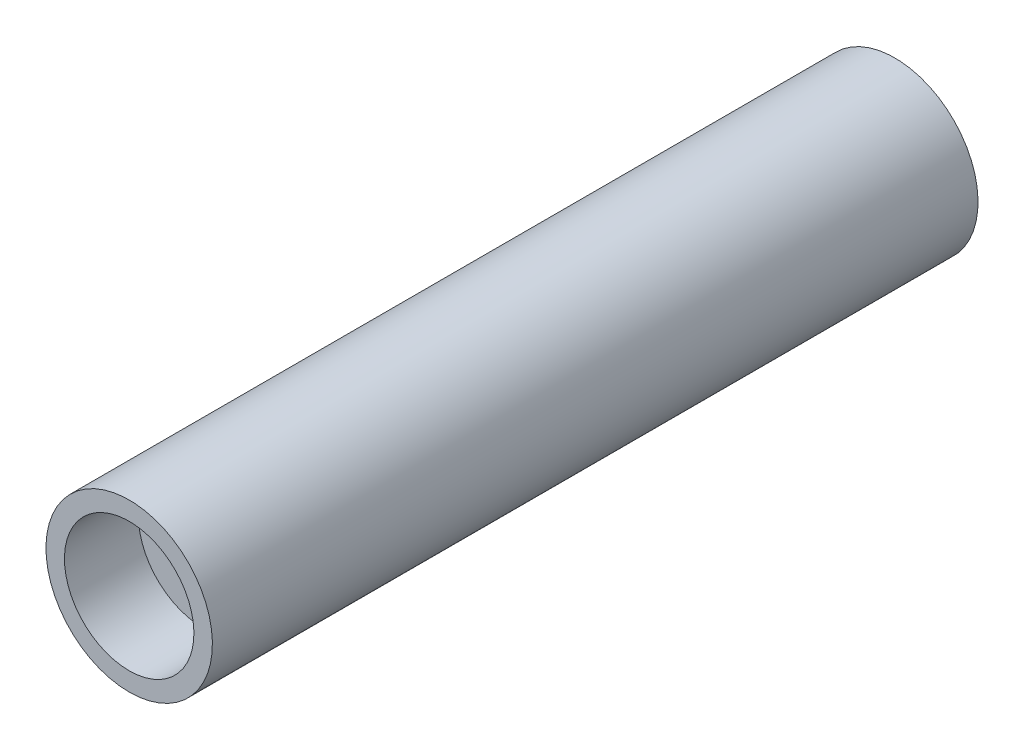
ISO-10303-21;
HEADER;
FILE_DESCRIPTION(('STEP AP214'),'2;1');
FILE_NAME('part.step','',(''),(''),'','','');
FILE_SCHEMA(('AUTOMOTIVE_DESIGN { 1 0 10303 214 1 1 1 1 }'));
ENDSEC;
DATA;
#1=APPLICATION_CONTEXT('core data for automotive mechanical design processes');
#2=APPLICATION_PROTOCOL_DEFINITION('international standard','automotive_design',2000,#1);
#3=PRODUCT_CONTEXT('',#1,'mechanical');
#4=PRODUCT('Part','Part','',(#3));
#5=PRODUCT_RELATED_PRODUCT_CATEGORY('part','',(#4));
#6=PRODUCT_DEFINITION_FORMATION('','',#4);
#7=PRODUCT_DEFINITION_CONTEXT('part definition',#1,'design');
#8=PRODUCT_DEFINITION('design','',#6,#7);
#9=PRODUCT_DEFINITION_SHAPE('','',#8);
#10=(LENGTH_UNIT() NAMED_UNIT(*) SI_UNIT(.MILLI.,.METRE.));
#11=(NAMED_UNIT(*) PLANE_ANGLE_UNIT() SI_UNIT($,.RADIAN.));
#12=(NAMED_UNIT(*) SI_UNIT($,.STERADIAN.) SOLID_ANGLE_UNIT());
#13=UNCERTAINTY_MEASURE_WITH_UNIT(LENGTH_MEASURE(1.E-05),#10,'distance_accuracy_value','');
#14=(GEOMETRIC_REPRESENTATION_CONTEXT(3) GLOBAL_UNCERTAINTY_ASSIGNED_CONTEXT((#13)) GLOBAL_UNIT_ASSIGNED_CONTEXT((#10,
#11,#12)) REPRESENTATION_CONTEXT('',''));
#15=CARTESIAN_POINT('',(0.,0.,0.));
#16=DIRECTION('',(0.,0.,1.));
#17=DIRECTION('',(1.,0.,0.));
#18=AXIS2_PLACEMENT_3D('',#15,#16,#17);
#19=CARTESIAN_POINT('',(0.,2.7,-12.42));
#20=DIRECTION('',(0.,0.,1.));
#21=DIRECTION('',(0.,-1.,0.));
#22=AXIS2_PLACEMENT_3D('',#19,#20,#21);
#23=PLANE('',#22);
#24=CARTESIAN_POINT('',(0.,0.,-12.42));
#25=DIRECTION('',(0.,0.,1.));
#26=DIRECTION('',(0.,-1.,0.));
#27=AXIS2_PLACEMENT_3D('',#24,#25,#26);
#28=CIRCLE('',#27,2.7);
#29=CARTESIAN_POINT('',(0.,-2.69999999999999,-12.42));
#30=VERTEX_POINT('',#29);
#31=EDGE_CURVE('E10',#30,#30,#28,.T.);
#32=ORIENTED_EDGE('',*,*,#31,.F.);
#33=EDGE_LOOP('',(#32));
#34=FACE_BOUND('',#33,.T.);
#35=CARTESIAN_POINT('',(0.,0.,-12.42));
#36=DIRECTION('',(0.,0.,1.));
#37=DIRECTION('',(0.,-1.,0.));
#38=AXIS2_PLACEMENT_3D('',#35,#36,#37);
#39=CIRCLE('',#38,2.1);
#40=CARTESIAN_POINT('',(0.,-2.09999999999999,-12.42));
#41=VERTEX_POINT('',#40);
#42=EDGE_CURVE('E60',#41,#41,#39,.T.);
#43=ORIENTED_EDGE('',*,*,#42,.T.);
#44=EDGE_LOOP('',(#43));
#45=FACE_BOUND('',#44,.T.);
#46=ADVANCED_FACE('F32',(#34,#45),#23,.F.);
#47=CARTESIAN_POINT('',(0.,0.,10.1580287602632));
#48=DIRECTION('',(0.,0.,1.));
#49=DIRECTION('',(0.,-1.,0.));
#50=AXIS2_PLACEMENT_3D('',#47,#48,#49);
#51=CYLINDRICAL_SURFACE('',#50,2.7);
#52=CARTESIAN_POINT('',(0.,0.,12.42));
#53=DIRECTION('',(0.,0.,1.));
#54=DIRECTION('',(0.,-1.,0.));
#55=AXIS2_PLACEMENT_3D('',#52,#53,#54);
#56=CIRCLE('',#55,2.7);
#57=CARTESIAN_POINT('',(0.,-2.7,12.42));
#58=VERTEX_POINT('',#57);
#59=EDGE_CURVE('E38',#58,#58,#56,.T.);
#60=ORIENTED_EDGE('',*,*,#59,.F.);
#61=EDGE_LOOP('',(#60));
#62=FACE_BOUND('',#61,.T.);
#63=ORIENTED_EDGE('',*,*,#31,.T.);
#64=EDGE_LOOP('',(#63));
#65=FACE_BOUND('',#64,.T.);
#66=ADVANCED_FACE('F97',(#62,#65),#51,.T.);
#67=CARTESIAN_POINT('',(0.,2.7,12.42));
#68=DIRECTION('',(0.,0.,-1.));
#69=DIRECTION('',(0.,1.,0.));
#70=AXIS2_PLACEMENT_3D('',#67,#68,#69);
#71=PLANE('',#70);
#72=CARTESIAN_POINT('',(0.,0.,12.42));
#73=DIRECTION('',(0.,0.,1.));
#74=DIRECTION('',(0.,-1.,0.));
#75=AXIS2_PLACEMENT_3D('',#72,#73,#74);
#76=CIRCLE('',#75,2.1);
#77=CARTESIAN_POINT('',(0.,-2.1,12.42));
#78=VERTEX_POINT('',#77);
#79=EDGE_CURVE('E42',#78,#78,#76,.T.);
#80=ORIENTED_EDGE('',*,*,#79,.F.);
#81=EDGE_LOOP('',(#80));
#82=FACE_BOUND('',#81,.T.);
#83=ORIENTED_EDGE('',*,*,#59,.T.);
#84=EDGE_LOOP('',(#83));
#85=FACE_BOUND('',#84,.T.);
#86=ADVANCED_FACE('F92',(#82,#85),#71,.F.);
#87=CARTESIAN_POINT('',(0.,0.,10.1580287602632));
#88=DIRECTION('',(0.,0.,1.));
#89=DIRECTION('',(0.,-1.,0.));
#90=AXIS2_PLACEMENT_3D('',#87,#88,#89);
#91=CYLINDRICAL_SURFACE('',#90,2.1);
#92=CARTESIAN_POINT('',(0.,0.,10.02));
#93=DIRECTION('',(0.,0.,1.));
#94=DIRECTION('',(0.,-1.,0.));
#95=AXIS2_PLACEMENT_3D('',#92,#93,#94);
#96=CIRCLE('',#95,2.1);
#97=CARTESIAN_POINT('',(0.,-2.1,10.02));
#98=VERTEX_POINT('',#97);
#99=EDGE_CURVE('E46',#98,#98,#96,.T.);
#100=ORIENTED_EDGE('',*,*,#99,.F.);
#101=EDGE_LOOP('',(#100));
#102=FACE_BOUND('',#101,.T.);
#103=ORIENTED_EDGE('',*,*,#79,.T.);
#104=EDGE_LOOP('',(#103));
#105=FACE_BOUND('',#104,.T.);
#106=ADVANCED_FACE('F86',(#102,#105),#91,.F.);
#107=CARTESIAN_POINT('',(0.,2.1,10.02));
#108=DIRECTION('',(0.,0.,-1.));
#109=DIRECTION('',(0.,1.,0.));
#110=AXIS2_PLACEMENT_3D('',#107,#108,#109);
#111=PLANE('',#110);
#112=CARTESIAN_POINT('',(0.,0.,10.02));
#113=DIRECTION('',(0.,0.,1.));
#114=DIRECTION('',(0.,-1.,0.));
#115=AXIS2_PLACEMENT_3D('',#112,#113,#114);
#116=CIRCLE('',#115,1.2);
#117=CARTESIAN_POINT('',(0.,-1.2,10.02));
#118=VERTEX_POINT('',#117);
#119=EDGE_CURVE('E51',#118,#118,#116,.T.);
#120=ORIENTED_EDGE('',*,*,#119,.F.);
#121=EDGE_LOOP('',(#120));
#122=FACE_BOUND('',#121,.T.);
#123=ORIENTED_EDGE('',*,*,#99,.T.);
#124=EDGE_LOOP('',(#123));
#125=FACE_BOUND('',#124,.T.);
#126=ADVANCED_FACE('F80',(#122,#125),#111,.F.);
#127=CARTESIAN_POINT('',(0.,0.,10.1580287602632));
#128=DIRECTION('',(0.,0.,1.));
#129=DIRECTION('',(0.,-1.,0.));
#130=AXIS2_PLACEMENT_3D('',#127,#128,#129);
#131=CYLINDRICAL_SURFACE('',#130,1.2);
#132=CARTESIAN_POINT('',(0.,0.,-10.02));
#133=DIRECTION('',(0.,0.,1.));
#134=DIRECTION('',(0.,-1.,0.));
#135=AXIS2_PLACEMENT_3D('',#132,#133,#134);
#136=CIRCLE('',#135,1.2);
#137=CARTESIAN_POINT('',(0.,-1.19999999999999,-10.02));
#138=VERTEX_POINT('',#137);
#139=EDGE_CURVE('E54',#138,#138,#136,.T.);
#140=ORIENTED_EDGE('',*,*,#139,.F.);
#141=EDGE_LOOP('',(#140));
#142=FACE_BOUND('',#141,.T.);
#143=ORIENTED_EDGE('',*,*,#119,.T.);
#144=EDGE_LOOP('',(#143));
#145=FACE_BOUND('',#144,.T.);
#146=ADVANCED_FACE('F74',(#142,#145),#131,.F.);
#147=CARTESIAN_POINT('',(0.,2.1,-10.02));
#148=DIRECTION('',(0.,0.,1.));
#149=DIRECTION('',(0.,-1.,0.));
#150=AXIS2_PLACEMENT_3D('',#147,#148,#149);
#151=PLANE('',#150);
#152=CARTESIAN_POINT('',(0.,0.,-10.02));
#153=DIRECTION('',(0.,0.,1.));
#154=DIRECTION('',(0.,-1.,0.));
#155=AXIS2_PLACEMENT_3D('',#152,#153,#154);
#156=CIRCLE('',#155,2.1);
#157=CARTESIAN_POINT('',(0.,-2.09999999999999,-10.02));
#158=VERTEX_POINT('',#157);
#159=EDGE_CURVE('E57',#158,#158,#156,.T.);
#160=ORIENTED_EDGE('',*,*,#159,.F.);
#161=EDGE_LOOP('',(#160));
#162=FACE_BOUND('',#161,.T.);
#163=ORIENTED_EDGE('',*,*,#139,.T.);
#164=EDGE_LOOP('',(#163));
#165=FACE_BOUND('',#164,.T.);
#166=ADVANCED_FACE('F68',(#162,#165),#151,.F.);
#167=CARTESIAN_POINT('',(0.,0.,10.1580287602632));
#168=DIRECTION('',(0.,0.,1.));
#169=DIRECTION('',(0.,-1.,0.));
#170=AXIS2_PLACEMENT_3D('',#167,#168,#169);
#171=CYLINDRICAL_SURFACE('',#170,2.1);
#172=ORIENTED_EDGE('',*,*,#42,.F.);
#173=EDGE_LOOP('',(#172));
#174=FACE_BOUND('',#173,.T.);
#175=ORIENTED_EDGE('',*,*,#159,.T.);
#176=EDGE_LOOP('',(#175));
#177=FACE_BOUND('',#176,.T.);
#178=ADVANCED_FACE('F65',(#174,#177),#171,.F.);
#179=CLOSED_SHELL('',(#46,#66,#86,#106,#126,#146,#166,#178));
#180=MANIFOLD_SOLID_BREP('B2',#179);
#181=ADVANCED_BREP_SHAPE_REPRESENTATION('',(#18,#180),#14);
#182=SHAPE_DEFINITION_REPRESENTATION(#9,#181);
ENDSEC;
END-ISO-10303-21;
